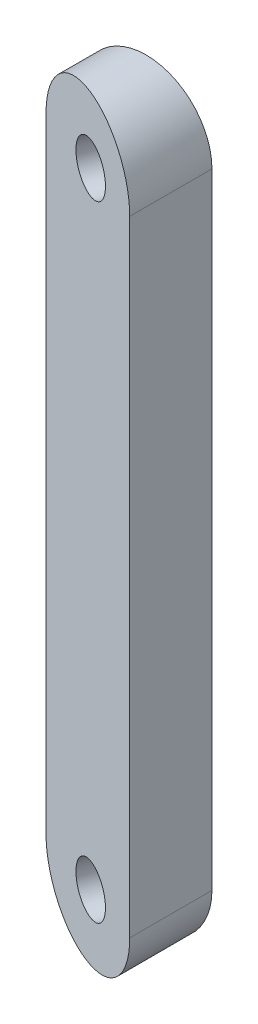
ISO-10303-21;
HEADER;
FILE_DESCRIPTION(('STEP AP214'),'2;1');
FILE_NAME('part.step','',(''),(''),'','','');
FILE_SCHEMA(('AUTOMOTIVE_DESIGN { 1 0 10303 214 1 1 1 1 }'));
ENDSEC;
DATA;
#1=APPLICATION_CONTEXT('core data for automotive mechanical design processes');
#2=APPLICATION_PROTOCOL_DEFINITION('international standard','automotive_design',2000,#1);
#3=PRODUCT_CONTEXT('',#1,'mechanical');
#4=PRODUCT('Part','Part','',(#3));
#5=PRODUCT_RELATED_PRODUCT_CATEGORY('part','',(#4));
#6=PRODUCT_DEFINITION_FORMATION('','',#4);
#7=PRODUCT_DEFINITION_CONTEXT('part definition',#1,'design');
#8=PRODUCT_DEFINITION('design','',#6,#7);
#9=PRODUCT_DEFINITION_SHAPE('','',#8);
#10=(LENGTH_UNIT() NAMED_UNIT(*) SI_UNIT(.MILLI.,.METRE.));
#11=(NAMED_UNIT(*) PLANE_ANGLE_UNIT() SI_UNIT($,.RADIAN.));
#12=(NAMED_UNIT(*) SI_UNIT($,.STERADIAN.) SOLID_ANGLE_UNIT());
#13=UNCERTAINTY_MEASURE_WITH_UNIT(LENGTH_MEASURE(1.E-05),#10,'distance_accuracy_value','');
#14=(GEOMETRIC_REPRESENTATION_CONTEXT(3) GLOBAL_UNCERTAINTY_ASSIGNED_CONTEXT((#13)) GLOBAL_UNIT_ASSIGNED_CONTEXT((#10,
#11,#12)) REPRESENTATION_CONTEXT('',''));
#15=CARTESIAN_POINT('',(0.,0.,0.));
#16=DIRECTION('',(0.,0.,1.));
#17=DIRECTION('',(1.,0.,0.));
#18=AXIS2_PLACEMENT_3D('',#15,#16,#17);
#19=CARTESIAN_POINT('',(68.3945900393653,19.,5.));
#20=DIRECTION('',(0.,0.,-1.));
#21=DIRECTION('',(-1.,0.,0.));
#22=AXIS2_PLACEMENT_3D('',#19,#20,#21);
#23=CYLINDRICAL_SURFACE('',#22,4.);
#24=DIRECTION('',(0.,0.,-1.));
#25=VECTOR('',#24,1.);
#26=CARTESIAN_POINT('',(64.3945900393653,19.,5.));
#27=LINE('',#26,#25);
#28=CARTESIAN_POINT('',(64.3945900393653,19.,2.08823812587035));
#29=VERTEX_POINT('',#28);
#30=CARTESIAN_POINT('',(64.3945900393653,19.,0.));
#31=VERTEX_POINT('',#30);
#32=EDGE_CURVE('E11',#29,#31,#27,.T.);
#33=ORIENTED_EDGE('',*,*,#32,.F.);
#34=CARTESIAN_POINT('',(68.3945900393653,19.,3.54411906293517));
#35=DIRECTION('',(0.342020143325672,0.,-0.939692620785907));
#36=DIRECTION('',(-0.939692620785907,0.,-0.342020143325672));
#37=AXIS2_PLACEMENT_3D('',#34,#35,#36);
#38=ELLIPSE('',#37,4.25671108990365,4.);
#39=CARTESIAN_POINT('',(72.3945900393653,19.,5.));
#40=VERTEX_POINT('',#39);
#41=EDGE_CURVE('E94',#29,#40,#38,.T.);
#42=ORIENTED_EDGE('',*,*,#41,.T.);
#43=DIRECTION('',(0.,0.,-1.));
#44=VECTOR('',#43,1.);
#45=CARTESIAN_POINT('',(72.3945900393653,19.,5.));
#46=LINE('',#45,#44);
#47=CARTESIAN_POINT('',(72.3945900393653,19.,0.));
#48=VERTEX_POINT('',#47);
#49=EDGE_CURVE('E80',#40,#48,#46,.T.);
#50=ORIENTED_EDGE('',*,*,#49,.T.);
#51=CARTESIAN_POINT('',(68.3945900393653,19.,0.));
#52=DIRECTION('',(0.,0.,1.));
#53=DIRECTION('',(1.,0.,0.));
#54=AXIS2_PLACEMENT_3D('',#51,#52,#53);
#55=CIRCLE('',#54,4.);
#56=EDGE_CURVE('E85',#48,#31,#55,.T.);
#57=ORIENTED_EDGE('',*,*,#56,.T.);
#58=EDGE_LOOP('',(#33,#42,#50,#57));
#59=FACE_BOUND('',#58,.T.);
#60=ADVANCED_FACE('F32',(#59),#23,.T.);
#61=CARTESIAN_POINT('',(64.3945900393653,19.,5.));
#62=DIRECTION('',(1.,0.,0.));
#63=DIRECTION('',(0.,0.,-1.));
#64=AXIS2_PLACEMENT_3D('',#61,#62,#63);
#65=PLANE('',#64);
#66=DIRECTION('',(0.,0.,-1.));
#67=VECTOR('',#66,1.);
#68=CARTESIAN_POINT('',(64.3945900393653,-19.,5.));
#69=LINE('',#68,#67);
#70=CARTESIAN_POINT('',(64.3945900393653,-19.,2.08823812587035));
#71=VERTEX_POINT('',#70);
#72=CARTESIAN_POINT('',(64.3945900393653,-19.,0.));
#73=VERTEX_POINT('',#72);
#74=EDGE_CURVE('E40',#71,#73,#69,.T.);
#75=ORIENTED_EDGE('',*,*,#74,.F.);
#76=DIRECTION('',(0.,1.,0.));
#77=VECTOR('',#76,1.);
#78=CARTESIAN_POINT('',(64.3945900393653,-23.,2.08823812587035));
#79=LINE('',#78,#77);
#80=EDGE_CURVE('E99',#71,#29,#79,.T.);
#81=ORIENTED_EDGE('',*,*,#80,.T.);
#82=ORIENTED_EDGE('',*,*,#32,.T.);
#83=DIRECTION('',(0.,-1.,0.));
#84=VECTOR('',#83,1.);
#85=CARTESIAN_POINT('',(64.3945900393653,19.,0.));
#86=LINE('',#85,#84);
#87=EDGE_CURVE('E73',#31,#73,#86,.T.);
#88=ORIENTED_EDGE('',*,*,#87,.T.);
#89=EDGE_LOOP('',(#75,#81,#82,#88));
#90=FACE_BOUND('',#89,.T.);
#91=ADVANCED_FACE('F105',(#90),#65,.F.);
#92=CARTESIAN_POINT('',(68.3945900393653,-19.,5.));
#93=DIRECTION('',(0.,0.,-1.));
#94=DIRECTION('',(-1.,0.,0.));
#95=AXIS2_PLACEMENT_3D('',#92,#93,#94);
#96=CYLINDRICAL_SURFACE('',#95,4.);
#97=DIRECTION('',(0.,0.,-1.));
#98=VECTOR('',#97,1.);
#99=CARTESIAN_POINT('',(72.3945900393653,-19.,5.));
#100=LINE('',#99,#98);
#101=CARTESIAN_POINT('',(72.3945900393653,-19.,5.));
#102=VERTEX_POINT('',#101);
#103=CARTESIAN_POINT('',(72.3945900393653,-19.,0.));
#104=VERTEX_POINT('',#103);
#105=EDGE_CURVE('E65',#102,#104,#100,.T.);
#106=ORIENTED_EDGE('',*,*,#105,.F.);
#107=CARTESIAN_POINT('',(68.3945900393653,-19.,3.54411906293517));
#108=DIRECTION('',(0.342020143325672,0.,-0.939692620785907));
#109=DIRECTION('',(-0.939692620785907,0.,-0.342020143325672));
#110=AXIS2_PLACEMENT_3D('',#107,#108,#109);
#111=ELLIPSE('',#110,4.25671108990365,4.);
#112=EDGE_CURVE('E47',#102,#71,#111,.T.);
#113=ORIENTED_EDGE('',*,*,#112,.T.);
#114=ORIENTED_EDGE('',*,*,#74,.T.);
#115=CARTESIAN_POINT('',(68.3945900393653,-19.,0.));
#116=DIRECTION('',(0.,0.,1.));
#117=DIRECTION('',(1.,0.,0.));
#118=AXIS2_PLACEMENT_3D('',#115,#116,#117);
#119=CIRCLE('',#118,4.);
#120=EDGE_CURVE('E62',#73,#104,#119,.T.);
#121=ORIENTED_EDGE('',*,*,#120,.T.);
#122=EDGE_LOOP('',(#106,#113,#114,#121));
#123=FACE_BOUND('',#122,.T.);
#124=ADVANCED_FACE('F64',(#123),#96,.T.);
#125=CARTESIAN_POINT('',(72.3945900393653,19.,5.));
#126=DIRECTION('',(-1.,0.,0.));
#127=DIRECTION('',(0.,0.,1.));
#128=AXIS2_PLACEMENT_3D('',#125,#126,#127);
#129=PLANE('',#128);
#130=DIRECTION('',(0.,1.,0.));
#131=VECTOR('',#130,1.);
#132=CARTESIAN_POINT('',(72.3945900393653,19.,0.));
#133=LINE('',#132,#131);
#134=EDGE_CURVE('E72',#104,#48,#133,.T.);
#135=ORIENTED_EDGE('',*,*,#134,.T.);
#136=ORIENTED_EDGE('',*,*,#49,.F.);
#137=DIRECTION('',(0.,1.,0.));
#138=VECTOR('',#137,1.);
#139=CARTESIAN_POINT('',(72.3945900393653,19.,5.));
#140=LINE('',#139,#138);
#141=EDGE_CURVE('E79',#102,#40,#140,.T.);
#142=ORIENTED_EDGE('',*,*,#141,.F.);
#143=ORIENTED_EDGE('',*,*,#105,.T.);
#144=EDGE_LOOP('',(#135,#136,#142,#143));
#145=FACE_BOUND('',#144,.T.);
#146=ADVANCED_FACE('F76',(#145),#129,.F.);
#147=CARTESIAN_POINT('',(68.3945900393653,19.,0.));
#148=DIRECTION('',(0.,0.,1.));
#149=DIRECTION('',(1.,0.,0.));
#150=AXIS2_PLACEMENT_3D('',#147,#148,#149);
#151=PLANE('',#150);
#152=CARTESIAN_POINT('',(69.9908566980782,-19.0000000000012,0.));
#153=DIRECTION('',(0.,0.,1.));
#154=DIRECTION('',(-1.,0.,0.));
#155=AXIS2_PLACEMENT_3D('',#152,#153,#154);
#156=ELLIPSE('',#155,1.59626665871385,1.49999999999998);
#157=CARTESIAN_POINT('',(68.3945900393643,-19.0000000000012,0.));
#158=VERTEX_POINT('',#157);
#159=EDGE_CURVE('E114',#158,#158,#156,.T.);
#160=ORIENTED_EDGE('',*,*,#159,.T.);
#161=EDGE_LOOP('',(#160));
#162=FACE_BOUND('',#161,.T.);
#163=CARTESIAN_POINT('',(69.9908566980791,18.9999999999988,0.));
#164=DIRECTION('',(0.,0.,1.));
#165=DIRECTION('',(-1.,0.,0.));
#166=AXIS2_PLACEMENT_3D('',#163,#164,#165);
#167=ELLIPSE('',#166,1.59626665871387,1.5);
#168=CARTESIAN_POINT('',(68.3945900393653,18.9999999999988,0.));
#169=VERTEX_POINT('',#168);
#170=EDGE_CURVE('E103',#169,#169,#167,.T.);
#171=ORIENTED_EDGE('',*,*,#170,.T.);
#172=EDGE_LOOP('',(#171));
#173=FACE_BOUND('',#172,.T.);
#174=ORIENTED_EDGE('',*,*,#56,.F.);
#175=ORIENTED_EDGE('',*,*,#134,.F.);
#176=ORIENTED_EDGE('',*,*,#120,.F.);
#177=ORIENTED_EDGE('',*,*,#87,.F.);
#178=EDGE_LOOP('',(#174,#175,#176,#177));
#179=FACE_BOUND('',#178,.T.);
#180=ADVANCED_FACE('F83',(#162,#173,#179),#151,.F.);
#181=CARTESIAN_POINT('',(72.3945900393653,-23.,5.));
#182=DIRECTION('',(0.342020143325672,0.,-0.939692620785907));
#183=DIRECTION('',(-0.939692620785907,0.,-0.342020143325672));
#184=AXIS2_PLACEMENT_3D('',#181,#182,#183);
#185=PLANE('',#184);
#186=CARTESIAN_POINT('',(68.665071060089,-19.0000000000012,3.64256610341254));
#187=DIRECTION('',(-0.342020143325673,0.,0.939692620785907));
#188=DIRECTION('',(0.939692620785907,0.,0.342020143325673));
#189=AXIS2_PLACEMENT_3D('',#186,#187,#188);
#190=CIRCLE('',#189,1.49999999999998);
#191=CARTESIAN_POINT('',(70.0746099912678,-19.0000000000012,4.15559631840105));
#192=VERTEX_POINT('',#191);
#193=EDGE_CURVE('E117',#192,#192,#190,.T.);
#194=ORIENTED_EDGE('',*,*,#193,.F.);
#195=EDGE_LOOP('',(#194));
#196=FACE_BOUND('',#195,.T.);
#197=CARTESIAN_POINT('',(68.6650710600898,18.9999999999988,3.64256610341285));
#198=DIRECTION('',(-0.342020143325673,0.,0.939692620785907));
#199=DIRECTION('',(0.939692620785907,0.,0.342020143325673));
#200=AXIS2_PLACEMENT_3D('',#197,#198,#199);
#201=CIRCLE('',#200,1.5);
#202=CARTESIAN_POINT('',(70.0746099912687,18.9999999999988,4.15559631840136));
#203=VERTEX_POINT('',#202);
#204=EDGE_CURVE('E111',#203,#203,#201,.T.);
#205=ORIENTED_EDGE('',*,*,#204,.F.);
#206=EDGE_LOOP('',(#205));
#207=FACE_BOUND('',#206,.T.);
#208=ORIENTED_EDGE('',*,*,#80,.F.);
#209=ORIENTED_EDGE('',*,*,#112,.F.);
#210=ORIENTED_EDGE('',*,*,#141,.T.);
#211=ORIENTED_EDGE('',*,*,#41,.F.);
#212=EDGE_LOOP('',(#208,#209,#210,#211));
#213=FACE_BOUND('',#212,.T.);
#214=ADVANCED_FACE('F101',(#196,#207,#213),#185,.F.);
#215=CARTESIAN_POINT('',(99.788904102726,18.9999999999988,-81.8694623881047));
#216=DIRECTION('',(-0.342020143325673,0.,0.939692620785907));
#217=DIRECTION('',(0.939692620785907,0.,0.342020143325673));
#218=AXIS2_PLACEMENT_3D('',#215,#216,#217);
#219=CYLINDRICAL_SURFACE('',#218,1.5);
#220=ORIENTED_EDGE('',*,*,#204,.T.);
#221=EDGE_LOOP('',(#220));
#222=FACE_BOUND('',#221,.T.);
#223=ORIENTED_EDGE('',*,*,#170,.F.);
#224=EDGE_LOOP('',(#223));
#225=FACE_BOUND('',#224,.T.);
#226=ADVANCED_FACE('F126',(#222,#225),#219,.F.);
#227=CARTESIAN_POINT('',(99.7889041027252,-19.0000000000012,-81.869462388105));
#228=DIRECTION('',(-0.342020143325673,0.,0.939692620785907));
#229=DIRECTION('',(0.939692620785907,0.,0.342020143325673));
#230=AXIS2_PLACEMENT_3D('',#227,#228,#229);
#231=CYLINDRICAL_SURFACE('',#230,1.49999999999998);
#232=ORIENTED_EDGE('',*,*,#193,.T.);
#233=EDGE_LOOP('',(#232));
#234=FACE_BOUND('',#233,.T.);
#235=ORIENTED_EDGE('',*,*,#159,.F.);
#236=EDGE_LOOP('',(#235));
#237=FACE_BOUND('',#236,.T.);
#238=ADVANCED_FACE('F121',(#234,#237),#231,.F.);
#239=CLOSED_SHELL('',(#60,#91,#124,#146,#180,#214,#226,#238));
#240=MANIFOLD_SOLID_BREP('B2',#239);
#241=ADVANCED_BREP_SHAPE_REPRESENTATION('',(#18,#240),#14);
#242=SHAPE_DEFINITION_REPRESENTATION(#9,#241);
ENDSEC;
END-ISO-10303-21;
